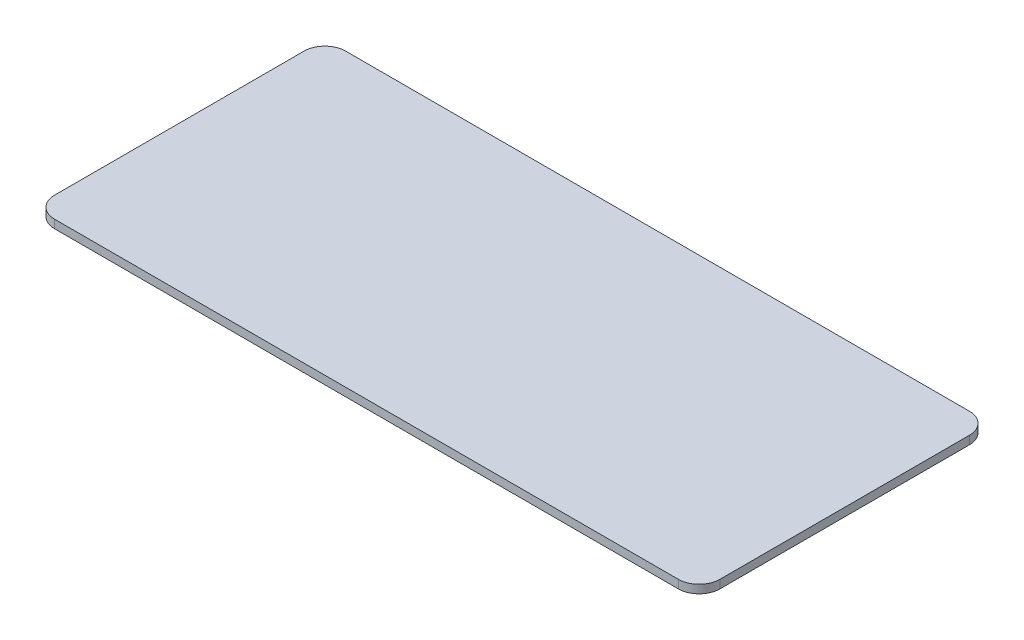
ISO-10303-21;
HEADER;
FILE_DESCRIPTION(('STEP AP214'),'2;1');
FILE_NAME('part.step','',(''),(''),'','','');
FILE_SCHEMA(('AUTOMOTIVE_DESIGN { 1 0 10303 214 1 1 1 1 }'));
ENDSEC;
DATA;
#1=APPLICATION_CONTEXT('core data for automotive mechanical design processes');
#2=APPLICATION_PROTOCOL_DEFINITION('international standard','automotive_design',2000,#1);
#3=PRODUCT_CONTEXT('',#1,'mechanical');
#4=PRODUCT('Part','Part','',(#3));
#5=PRODUCT_RELATED_PRODUCT_CATEGORY('part','',(#4));
#6=PRODUCT_DEFINITION_FORMATION('','',#4);
#7=PRODUCT_DEFINITION_CONTEXT('part definition',#1,'design');
#8=PRODUCT_DEFINITION('design','',#6,#7);
#9=PRODUCT_DEFINITION_SHAPE('','',#8);
#10=(LENGTH_UNIT() NAMED_UNIT(*) SI_UNIT(.MILLI.,.METRE.));
#11=(NAMED_UNIT(*) PLANE_ANGLE_UNIT() SI_UNIT($,.RADIAN.));
#12=(NAMED_UNIT(*) SI_UNIT($,.STERADIAN.) SOLID_ANGLE_UNIT());
#13=UNCERTAINTY_MEASURE_WITH_UNIT(LENGTH_MEASURE(1.E-05),#10,'distance_accuracy_value','');
#14=(GEOMETRIC_REPRESENTATION_CONTEXT(3) GLOBAL_UNCERTAINTY_ASSIGNED_CONTEXT((#13)) GLOBAL_UNIT_ASSIGNED_CONTEXT((#10,
#11,#12)) REPRESENTATION_CONTEXT('',''));
#15=CARTESIAN_POINT('',(0.,0.,0.));
#16=DIRECTION('',(0.,0.,1.));
#17=DIRECTION('',(1.,0.,0.));
#18=AXIS2_PLACEMENT_3D('',#15,#16,#17);
#19=CARTESIAN_POINT('',(0.,2.,0.));
#20=DIRECTION('',(0.,-1.,0.));
#21=DIRECTION('',(0.,0.,-1.));
#22=AXIS2_PLACEMENT_3D('',#19,#20,#21);
#23=PLANE('',#22);
#24=CARTESIAN_POINT('',(-93.3544303797468,2.,-42.8481012658228));
#25=DIRECTION('',(0.,-1.,0.));
#26=DIRECTION('',(0.,0.,-1.));
#27=AXIS2_PLACEMENT_3D('',#24,#25,#26);
#28=CIRCLE('',#27,5.);
#29=CARTESIAN_POINT('',(-93.3544303797468,2.,-47.8481012658228));
#30=VERTEX_POINT('',#29);
#31=CARTESIAN_POINT('',(-98.3544303797468,2.,-42.8481012658228));
#32=VERTEX_POINT('',#31);
#33=EDGE_CURVE('E39',#30,#32,#28,.F.);
#34=ORIENTED_EDGE('',*,*,#33,.T.);
#35=DIRECTION('',(0.,0.,-1.));
#36=VECTOR('',#35,1.);
#37=CARTESIAN_POINT('',(-98.3544303797468,2.,-47.8481012658228));
#38=LINE('',#37,#36);
#39=CARTESIAN_POINT('',(-98.3544303797468,2.,17.1518987341772));
#40=VERTEX_POINT('',#39);
#41=EDGE_CURVE('E155',#40,#32,#38,.T.);
#42=ORIENTED_EDGE('',*,*,#41,.F.);
#43=CARTESIAN_POINT('',(-93.3544303797468,2.,17.1518987341772));
#44=DIRECTION('',(0.,-1.,0.));
#45=DIRECTION('',(0.,0.,-1.));
#46=AXIS2_PLACEMENT_3D('',#43,#44,#45);
#47=CIRCLE('',#46,5.);
#48=CARTESIAN_POINT('',(-93.3544303797468,2.,22.1518987341772));
#49=VERTEX_POINT('',#48);
#50=EDGE_CURVE('E157',#40,#49,#47,.F.);
#51=ORIENTED_EDGE('',*,*,#50,.T.);
#52=DIRECTION('',(-1.,0.,0.));
#53=VECTOR('',#52,1.);
#54=CARTESIAN_POINT('',(-98.3544303797468,2.,22.1518987341772));
#55=LINE('',#54,#53);
#56=CARTESIAN_POINT('',(56.6455696202532,2.,22.1518987341772));
#57=VERTEX_POINT('',#56);
#58=EDGE_CURVE('E108',#57,#49,#55,.T.);
#59=ORIENTED_EDGE('',*,*,#58,.F.);
#60=CARTESIAN_POINT('',(56.6455696202532,2.,17.1518987341772));
#61=DIRECTION('',(0.,-1.,0.));
#62=DIRECTION('',(0.,0.,-1.));
#63=AXIS2_PLACEMENT_3D('',#60,#61,#62);
#64=CIRCLE('',#63,5.);
#65=CARTESIAN_POINT('',(61.6455696202532,2.,17.1518987341772));
#66=VERTEX_POINT('',#65);
#67=EDGE_CURVE('E11',#57,#66,#64,.F.);
#68=ORIENTED_EDGE('',*,*,#67,.T.);
#69=DIRECTION('',(0.,0.,1.));
#70=VECTOR('',#69,1.);
#71=CARTESIAN_POINT('',(61.6455696202532,2.,-47.8481012658228));
#72=LINE('',#71,#70);
#73=CARTESIAN_POINT('',(61.6455696202532,2.,-42.8481012658228));
#74=VERTEX_POINT('',#73);
#75=EDGE_CURVE('E58',#74,#66,#72,.T.);
#76=ORIENTED_EDGE('',*,*,#75,.F.);
#77=CARTESIAN_POINT('',(56.6455696202532,2.,-42.8481012658228));
#78=DIRECTION('',(0.,-1.,0.));
#79=DIRECTION('',(0.,0.,-1.));
#80=AXIS2_PLACEMENT_3D('',#77,#78,#79);
#81=CIRCLE('',#80,5.);
#82=CARTESIAN_POINT('',(56.6455696202532,2.,-47.8481012658228));
#83=VERTEX_POINT('',#82);
#84=EDGE_CURVE('E44',#74,#83,#81,.F.);
#85=ORIENTED_EDGE('',*,*,#84,.T.);
#86=DIRECTION('',(1.,0.,0.));
#87=VECTOR('',#86,1.);
#88=CARTESIAN_POINT('',(-98.3544303797468,2.,-47.8481012658228));
#89=LINE('',#88,#87);
#90=EDGE_CURVE('E152',#30,#83,#89,.T.);
#91=ORIENTED_EDGE('',*,*,#90,.F.);
#92=EDGE_LOOP('',(#34,#42,#51,#59,#68,#76,#85,#91));
#93=FACE_BOUND('',#92,.T.);
#94=ADVANCED_FACE('F35',(#93),#23,.F.);
#95=CARTESIAN_POINT('',(-98.3544303797468,50.,-47.8481012658228));
#96=DIRECTION('',(1.,0.,0.));
#97=DIRECTION('',(0.,0.,-1.));
#98=AXIS2_PLACEMENT_3D('',#95,#96,#97);
#99=PLANE('',#98);
#100=DIRECTION('',(0.,-1.,0.));
#101=VECTOR('',#100,1.);
#102=CARTESIAN_POINT('',(-98.3544303797468,50.,17.1518987341772));
#103=LINE('',#102,#101);
#104=CARTESIAN_POINT('',(-98.3544303797468,0.,17.1518987341772));
#105=VERTEX_POINT('',#104);
#106=EDGE_CURVE('E118',#105,#40,#103,.F.);
#107=ORIENTED_EDGE('',*,*,#106,.T.);
#108=ORIENTED_EDGE('',*,*,#41,.T.);
#109=DIRECTION('',(0.,-1.,0.));
#110=VECTOR('',#109,1.);
#111=CARTESIAN_POINT('',(-98.3544303797468,50.,-42.8481012658228));
#112=LINE('',#111,#110);
#113=CARTESIAN_POINT('',(-98.3544303797468,0.,-42.8481012658228));
#114=VERTEX_POINT('',#113);
#115=EDGE_CURVE('E122',#32,#114,#112,.T.);
#116=ORIENTED_EDGE('',*,*,#115,.T.);
#117=DIRECTION('',(0.,0.,1.));
#118=VECTOR('',#117,1.);
#119=CARTESIAN_POINT('',(-98.3544303797468,0.,-47.8481012658228));
#120=LINE('',#119,#118);
#121=EDGE_CURVE('E128',#114,#105,#120,.T.);
#122=ORIENTED_EDGE('',*,*,#121,.T.);
#123=EDGE_LOOP('',(#107,#108,#116,#122));
#124=FACE_BOUND('',#123,.T.);
#125=ADVANCED_FACE('F164',(#124),#99,.F.);
#126=CARTESIAN_POINT('',(-98.3544303797468,50.,-47.8481012658228));
#127=DIRECTION('',(0.,0.,1.));
#128=DIRECTION('',(1.,0.,0.));
#129=AXIS2_PLACEMENT_3D('',#126,#127,#128);
#130=PLANE('',#129);
#131=DIRECTION('',(0.,-1.,0.));
#132=VECTOR('',#131,1.);
#133=CARTESIAN_POINT('',(-93.3544303797468,50.,-47.8481012658228));
#134=LINE('',#133,#132);
#135=CARTESIAN_POINT('',(-93.3544303797468,0.,-47.8481012658228));
#136=VERTEX_POINT('',#135);
#137=EDGE_CURVE('E146',#136,#30,#134,.F.);
#138=ORIENTED_EDGE('',*,*,#137,.T.);
#139=ORIENTED_EDGE('',*,*,#90,.T.);
#140=DIRECTION('',(0.,-1.,0.));
#141=VECTOR('',#140,1.);
#142=CARTESIAN_POINT('',(56.6455696202532,50.,-47.8481012658228));
#143=LINE('',#142,#141);
#144=CARTESIAN_POINT('',(56.6455696202532,0.,-47.8481012658228));
#145=VERTEX_POINT('',#144);
#146=EDGE_CURVE('E144',#83,#145,#143,.T.);
#147=ORIENTED_EDGE('',*,*,#146,.T.);
#148=DIRECTION('',(-1.,0.,0.));
#149=VECTOR('',#148,1.);
#150=CARTESIAN_POINT('',(-98.3544303797468,0.,-47.8481012658228));
#151=LINE('',#150,#149);
#152=EDGE_CURVE('E133',#145,#136,#151,.T.);
#153=ORIENTED_EDGE('',*,*,#152,.T.);
#154=EDGE_LOOP('',(#138,#139,#147,#153));
#155=FACE_BOUND('',#154,.T.);
#156=ADVANCED_FACE('F175',(#155),#130,.F.);
#157=CARTESIAN_POINT('',(61.6455696202532,50.,-47.8481012658228));
#158=DIRECTION('',(-1.,0.,0.));
#159=DIRECTION('',(0.,0.,1.));
#160=AXIS2_PLACEMENT_3D('',#157,#158,#159);
#161=PLANE('',#160);
#162=DIRECTION('',(0.,-1.,0.));
#163=VECTOR('',#162,1.);
#164=CARTESIAN_POINT('',(61.6455696202532,50.,-42.8481012658228));
#165=LINE('',#164,#163);
#166=CARTESIAN_POINT('',(61.6455696202532,0.,-42.8481012658228));
#167=VERTEX_POINT('',#166);
#168=EDGE_CURVE('E151',#167,#74,#165,.F.);
#169=ORIENTED_EDGE('',*,*,#168,.T.);
#170=ORIENTED_EDGE('',*,*,#75,.T.);
#171=DIRECTION('',(0.,-1.,0.));
#172=VECTOR('',#171,1.);
#173=CARTESIAN_POINT('',(61.6455696202532,50.,17.1518987341772));
#174=LINE('',#173,#172);
#175=CARTESIAN_POINT('',(61.6455696202532,0.,17.1518987341772));
#176=VERTEX_POINT('',#175);
#177=EDGE_CURVE('E149',#66,#176,#174,.T.);
#178=ORIENTED_EDGE('',*,*,#177,.T.);
#179=DIRECTION('',(0.,0.,-1.));
#180=VECTOR('',#179,1.);
#181=CARTESIAN_POINT('',(61.6455696202532,0.,-47.8481012658228));
#182=LINE('',#181,#180);
#183=EDGE_CURVE('E129',#176,#167,#182,.T.);
#184=ORIENTED_EDGE('',*,*,#183,.T.);
#185=EDGE_LOOP('',(#169,#170,#178,#184));
#186=FACE_BOUND('',#185,.T.);
#187=ADVANCED_FACE('F181',(#186),#161,.F.);
#188=CARTESIAN_POINT('',(0.,0.,0.));
#189=DIRECTION('',(0.,1.,0.));
#190=DIRECTION('',(0.,0.,1.));
#191=AXIS2_PLACEMENT_3D('',#188,#189,#190);
#192=PLANE('',#191);
#193=DIRECTION('',(1.,0.,0.));
#194=VECTOR('',#193,1.);
#195=CARTESIAN_POINT('',(-98.3544303797468,0.,22.1518987341772));
#196=LINE('',#195,#194);
#197=CARTESIAN_POINT('',(-93.3544303797468,0.,22.1518987341772));
#198=VERTEX_POINT('',#197);
#199=CARTESIAN_POINT('',(56.6455696202532,0.,22.1518987341772));
#200=VERTEX_POINT('',#199);
#201=EDGE_CURVE('E107',#198,#200,#196,.T.);
#202=ORIENTED_EDGE('',*,*,#201,.F.);
#203=CARTESIAN_POINT('',(-93.3544303797468,0.,17.1518987341772));
#204=DIRECTION('',(0.,1.,0.));
#205=DIRECTION('',(0.,0.,1.));
#206=AXIS2_PLACEMENT_3D('',#203,#204,#205);
#207=CIRCLE('',#206,5.);
#208=EDGE_CURVE('E115',#198,#105,#207,.F.);
#209=ORIENTED_EDGE('',*,*,#208,.T.);
#210=ORIENTED_EDGE('',*,*,#121,.F.);
#211=CARTESIAN_POINT('',(-93.3544303797468,0.,-42.8481012658228));
#212=DIRECTION('',(0.,1.,0.));
#213=DIRECTION('',(0.,0.,1.));
#214=AXIS2_PLACEMENT_3D('',#211,#212,#213);
#215=CIRCLE('',#214,5.);
#216=EDGE_CURVE('E123',#114,#136,#215,.F.);
#217=ORIENTED_EDGE('',*,*,#216,.T.);
#218=ORIENTED_EDGE('',*,*,#152,.F.);
#219=CARTESIAN_POINT('',(56.6455696202532,0.,-42.8481012658228));
#220=DIRECTION('',(0.,1.,0.));
#221=DIRECTION('',(0.,0.,1.));
#222=AXIS2_PLACEMENT_3D('',#219,#220,#221);
#223=CIRCLE('',#222,5.);
#224=EDGE_CURVE('E139',#145,#167,#223,.F.);
#225=ORIENTED_EDGE('',*,*,#224,.T.);
#226=ORIENTED_EDGE('',*,*,#183,.F.);
#227=CARTESIAN_POINT('',(56.6455696202532,0.,17.1518987341772));
#228=DIRECTION('',(0.,1.,0.));
#229=DIRECTION('',(0.,0.,1.));
#230=AXIS2_PLACEMENT_3D('',#227,#228,#229);
#231=CIRCLE('',#230,5.);
#232=EDGE_CURVE('E111',#176,#200,#231,.F.);
#233=ORIENTED_EDGE('',*,*,#232,.T.);
#234=EDGE_LOOP('',(#202,#209,#210,#217,#218,#225,#226,#233));
#235=FACE_BOUND('',#234,.T.);
#236=ADVANCED_FACE('F125',(#235),#192,.F.);
#237=CARTESIAN_POINT('',(-98.3544303797468,50.,22.1518987341772));
#238=DIRECTION('',(0.,0.,-1.));
#239=DIRECTION('',(-1.,0.,0.));
#240=AXIS2_PLACEMENT_3D('',#237,#238,#239);
#241=PLANE('',#240);
#242=DIRECTION('',(0.,-1.,0.));
#243=VECTOR('',#242,1.);
#244=CARTESIAN_POINT('',(56.6455696202532,50.,22.1518987341772));
#245=LINE('',#244,#243);
#246=EDGE_CURVE('E112',#200,#57,#245,.F.);
#247=ORIENTED_EDGE('',*,*,#246,.T.);
#248=ORIENTED_EDGE('',*,*,#58,.T.);
#249=DIRECTION('',(0.,-1.,0.));
#250=VECTOR('',#249,1.);
#251=CARTESIAN_POINT('',(-93.3544303797468,50.,22.1518987341772));
#252=LINE('',#251,#250);
#253=EDGE_CURVE('E102',#49,#198,#252,.T.);
#254=ORIENTED_EDGE('',*,*,#253,.T.);
#255=ORIENTED_EDGE('',*,*,#201,.T.);
#256=EDGE_LOOP('',(#247,#248,#254,#255));
#257=FACE_BOUND('',#256,.T.);
#258=ADVANCED_FACE('F105',(#257),#241,.F.);
#259=CARTESIAN_POINT('',(56.6455696202532,50.,17.1518987341772));
#260=DIRECTION('',(0.,-1.,0.));
#261=DIRECTION('',(0.,0.,-1.));
#262=AXIS2_PLACEMENT_3D('',#259,#260,#261);
#263=CYLINDRICAL_SURFACE('',#262,5.);
#264=ORIENTED_EDGE('',*,*,#67,.F.);
#265=ORIENTED_EDGE('',*,*,#246,.F.);
#266=ORIENTED_EDGE('',*,*,#232,.F.);
#267=ORIENTED_EDGE('',*,*,#177,.F.);
#268=EDGE_LOOP('',(#264,#265,#266,#267));
#269=FACE_BOUND('',#268,.T.);
#270=ADVANCED_FACE('F37',(#269),#263,.T.);
#271=CARTESIAN_POINT('',(56.6455696202532,50.,-42.8481012658228));
#272=DIRECTION('',(0.,-1.,0.));
#273=DIRECTION('',(0.,0.,-1.));
#274=AXIS2_PLACEMENT_3D('',#271,#272,#273);
#275=CYLINDRICAL_SURFACE('',#274,5.);
#276=ORIENTED_EDGE('',*,*,#84,.F.);
#277=ORIENTED_EDGE('',*,*,#168,.F.);
#278=ORIENTED_EDGE('',*,*,#224,.F.);
#279=ORIENTED_EDGE('',*,*,#146,.F.);
#280=EDGE_LOOP('',(#276,#277,#278,#279));
#281=FACE_BOUND('',#280,.T.);
#282=ADVANCED_FACE('F180',(#281),#275,.T.);
#283=CARTESIAN_POINT('',(-93.3544303797468,50.,-42.8481012658228));
#284=DIRECTION('',(0.,-1.,0.));
#285=DIRECTION('',(0.,0.,-1.));
#286=AXIS2_PLACEMENT_3D('',#283,#284,#285);
#287=CYLINDRICAL_SURFACE('',#286,5.);
#288=ORIENTED_EDGE('',*,*,#33,.F.);
#289=ORIENTED_EDGE('',*,*,#137,.F.);
#290=ORIENTED_EDGE('',*,*,#216,.F.);
#291=ORIENTED_EDGE('',*,*,#115,.F.);
#292=EDGE_LOOP('',(#288,#289,#290,#291));
#293=FACE_BOUND('',#292,.T.);
#294=ADVANCED_FACE('F171',(#293),#287,.T.);
#295=CARTESIAN_POINT('',(-93.3544303797468,50.,17.1518987341772));
#296=DIRECTION('',(0.,-1.,0.));
#297=DIRECTION('',(0.,0.,-1.));
#298=AXIS2_PLACEMENT_3D('',#295,#296,#297);
#299=CYLINDRICAL_SURFACE('',#298,5.);
#300=ORIENTED_EDGE('',*,*,#50,.F.);
#301=ORIENTED_EDGE('',*,*,#106,.F.);
#302=ORIENTED_EDGE('',*,*,#208,.F.);
#303=ORIENTED_EDGE('',*,*,#253,.F.);
#304=EDGE_LOOP('',(#300,#301,#302,#303));
#305=FACE_BOUND('',#304,.T.);
#306=ADVANCED_FACE('F116',(#305),#299,.T.);
#307=CLOSED_SHELL('',(#94,#125,#156,#187,#236,#258,#270,#282,#294,#306));
#308=MANIFOLD_SOLID_BREP('B2',#307);
#309=ADVANCED_BREP_SHAPE_REPRESENTATION('',(#18,#308),#14);
#310=SHAPE_DEFINITION_REPRESENTATION(#9,#309);
ENDSEC;
END-ISO-10303-21;
